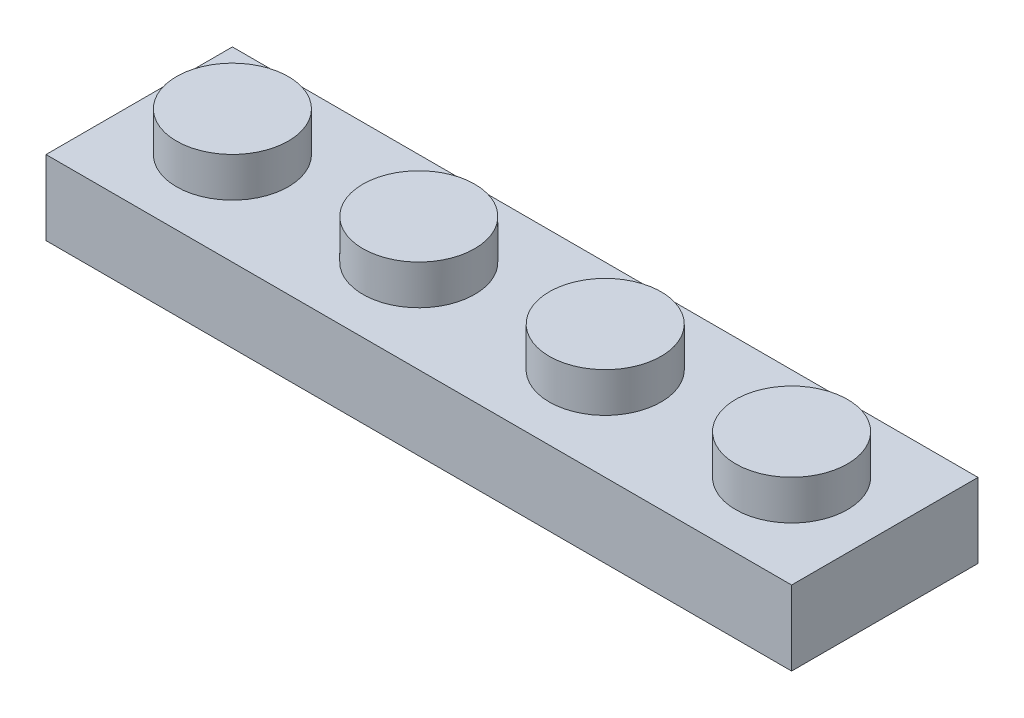
ISO-10303-21;
HEADER;
FILE_DESCRIPTION(('STEP AP214'),'2;1');
FILE_NAME('part.step','',(''),(''),'','','');
FILE_SCHEMA(('AUTOMOTIVE_DESIGN { 1 0 10303 214 1 1 1 1 }'));
ENDSEC;
DATA;
#1=APPLICATION_CONTEXT('core data for automotive mechanical design processes');
#2=APPLICATION_PROTOCOL_DEFINITION('international standard','automotive_design',2000,#1);
#3=PRODUCT_CONTEXT('',#1,'mechanical');
#4=PRODUCT('Part','Part','',(#3));
#5=PRODUCT_RELATED_PRODUCT_CATEGORY('part','',(#4));
#6=PRODUCT_DEFINITION_FORMATION('','',#4);
#7=PRODUCT_DEFINITION_CONTEXT('part definition',#1,'design');
#8=PRODUCT_DEFINITION('design','',#6,#7);
#9=PRODUCT_DEFINITION_SHAPE('','',#8);
#10=(LENGTH_UNIT() NAMED_UNIT(*) SI_UNIT(.MILLI.,.METRE.));
#11=(NAMED_UNIT(*) PLANE_ANGLE_UNIT() SI_UNIT($,.RADIAN.));
#12=(NAMED_UNIT(*) SI_UNIT($,.STERADIAN.) SOLID_ANGLE_UNIT());
#13=UNCERTAINTY_MEASURE_WITH_UNIT(LENGTH_MEASURE(1.E-05),#10,'distance_accuracy_value','');
#14=(GEOMETRIC_REPRESENTATION_CONTEXT(3) GLOBAL_UNCERTAINTY_ASSIGNED_CONTEXT((#13)) GLOBAL_UNIT_ASSIGNED_CONTEXT((#10,
#11,#12)) REPRESENTATION_CONTEXT('',''));
#15=CARTESIAN_POINT('',(0.,0.,0.));
#16=DIRECTION('',(0.,0.,1.));
#17=DIRECTION('',(1.,0.,0.));
#18=AXIS2_PLACEMENT_3D('',#15,#16,#17);
#19=CARTESIAN_POINT('',(0.,0.,0.));
#20=DIRECTION('',(0.,-1.,0.));
#21=DIRECTION('',(0.,0.,-1.));
#22=AXIS2_PLACEMENT_3D('',#19,#20,#21);
#23=PLANE('',#22);
#24=DIRECTION('',(-1.,0.,0.));
#25=VECTOR('',#24,1.);
#26=CARTESIAN_POINT('',(-4.,0.,-4.));
#27=LINE('',#26,#25);
#28=CARTESIAN_POINT('',(28.,0.,-4.));
#29=VERTEX_POINT('',#28);
#30=CARTESIAN_POINT('',(-4.,0.,-4.));
#31=VERTEX_POINT('',#30);
#32=EDGE_CURVE('E81',#29,#31,#27,.T.);
#33=ORIENTED_EDGE('',*,*,#32,.F.);
#34=DIRECTION('',(0.,0.,-1.));
#35=VECTOR('',#34,1.);
#36=CARTESIAN_POINT('',(28.,0.,4.));
#37=LINE('',#36,#35);
#38=CARTESIAN_POINT('',(28.,0.,4.));
#39=VERTEX_POINT('',#38);
#40=EDGE_CURVE('E94',#39,#29,#37,.T.);
#41=ORIENTED_EDGE('',*,*,#40,.F.);
#42=DIRECTION('',(1.,0.,0.));
#43=VECTOR('',#42,1.);
#44=CARTESIAN_POINT('',(-4.,0.,4.));
#45=LINE('',#44,#43);
#46=CARTESIAN_POINT('',(-4.,0.,4.));
#47=VERTEX_POINT('',#46);
#48=EDGE_CURVE('E80',#47,#39,#45,.T.);
#49=ORIENTED_EDGE('',*,*,#48,.F.);
#50=DIRECTION('',(0.,0.,1.));
#51=VECTOR('',#50,1.);
#52=CARTESIAN_POINT('',(-4.,0.,4.));
#53=LINE('',#52,#51);
#54=EDGE_CURVE('E70',#31,#47,#53,.T.);
#55=ORIENTED_EDGE('',*,*,#54,.F.);
#56=EDGE_LOOP('',(#33,#41,#49,#55));
#57=FACE_BOUND('',#56,.T.);
#58=DIRECTION('',(0.,0.,-1.));
#59=VECTOR('',#58,1.);
#60=CARTESIAN_POINT('',(26.4,0.,0.));
#61=LINE('',#60,#59);
#62=CARTESIAN_POINT('',(26.4,0.,2.4));
#63=VERTEX_POINT('',#62);
#64=CARTESIAN_POINT('',(26.4,0.,-2.4));
#65=VERTEX_POINT('',#64);
#66=EDGE_CURVE('E395',#63,#65,#61,.T.);
#67=ORIENTED_EDGE('',*,*,#66,.T.);
#68=DIRECTION('',(-1.,0.,0.));
#69=VECTOR('',#68,1.);
#70=CARTESIAN_POINT('',(0.,0.,-2.4));
#71=LINE('',#70,#69);
#72=CARTESIAN_POINT('',(-2.4,0.,-2.4));
#73=VERTEX_POINT('',#72);
#74=EDGE_CURVE('E392',#65,#73,#71,.T.);
#75=ORIENTED_EDGE('',*,*,#74,.T.);
#76=DIRECTION('',(0.,0.,1.));
#77=VECTOR('',#76,1.);
#78=CARTESIAN_POINT('',(-2.4,0.,0.));
#79=LINE('',#78,#77);
#80=CARTESIAN_POINT('',(-2.4,0.,2.4));
#81=VERTEX_POINT('',#80);
#82=EDGE_CURVE('E389',#73,#81,#79,.T.);
#83=ORIENTED_EDGE('',*,*,#82,.T.);
#84=DIRECTION('',(1.,0.,0.));
#85=VECTOR('',#84,1.);
#86=CARTESIAN_POINT('',(0.,0.,2.4));
#87=LINE('',#86,#85);
#88=EDGE_CURVE('E48',#81,#63,#87,.T.);
#89=ORIENTED_EDGE('',*,*,#88,.T.);
#90=EDGE_LOOP('',(#67,#75,#83,#89));
#91=FACE_BOUND('',#90,.T.);
#92=ADVANCED_FACE('F33',(#57,#91),#23,.T.);
#93=CARTESIAN_POINT('',(24.,4.9,0.));
#94=DIRECTION('',(0.,1.,0.));
#95=DIRECTION('',(0.,0.,1.));
#96=AXIS2_PLACEMENT_3D('',#93,#94,#95);
#97=PLANE('',#96);
#98=CARTESIAN_POINT('',(24.,4.9,0.));
#99=DIRECTION('',(0.,1.,0.));
#100=DIRECTION('',(0.,0.,1.));
#101=AXIS2_PLACEMENT_3D('',#98,#99,#100);
#102=CIRCLE('',#101,2.4);
#103=CARTESIAN_POINT('',(24.,4.9,2.4));
#104=VERTEX_POINT('',#103);
#105=EDGE_CURVE('E11',#104,#104,#102,.T.);
#106=ORIENTED_EDGE('',*,*,#105,.T.);
#107=EDGE_LOOP('',(#106));
#108=FACE_BOUND('',#107,.T.);
#109=ADVANCED_FACE('F35',(#108),#97,.T.);
#110=CARTESIAN_POINT('',(24.,4.9,0.));
#111=DIRECTION('',(0.,-1.,0.));
#112=DIRECTION('',(0.,0.,-1.));
#113=AXIS2_PLACEMENT_3D('',#110,#111,#112);
#114=CYLINDRICAL_SURFACE('',#113,2.4);
#115=ORIENTED_EDGE('',*,*,#105,.F.);
#116=EDGE_LOOP('',(#115));
#117=FACE_BOUND('',#116,.T.);
#118=CARTESIAN_POINT('',(24.,3.2,0.));
#119=DIRECTION('',(0.,1.,0.));
#120=DIRECTION('',(0.,0.,1.));
#121=AXIS2_PLACEMENT_3D('',#118,#119,#120);
#122=CIRCLE('',#121,2.4);
#123=CARTESIAN_POINT('',(24.,3.2,2.4));
#124=VERTEX_POINT('',#123);
#125=EDGE_CURVE('E41',#124,#124,#122,.T.);
#126=ORIENTED_EDGE('',*,*,#125,.T.);
#127=EDGE_LOOP('',(#126));
#128=FACE_BOUND('',#127,.T.);
#129=ADVANCED_FACE('F113',(#117,#128),#114,.T.);
#130=CARTESIAN_POINT('',(16.,4.9,0.));
#131=DIRECTION('',(0.,1.,0.));
#132=DIRECTION('',(0.,0.,1.));
#133=AXIS2_PLACEMENT_3D('',#130,#131,#132);
#134=PLANE('',#133);
#135=CARTESIAN_POINT('',(16.,4.9,0.));
#136=DIRECTION('',(0.,1.,0.));
#137=DIRECTION('',(0.,0.,1.));
#138=AXIS2_PLACEMENT_3D('',#135,#136,#137);
#139=CIRCLE('',#138,2.4);
#140=CARTESIAN_POINT('',(16.,4.9,2.4));
#141=VERTEX_POINT('',#140);
#142=EDGE_CURVE('E108',#141,#141,#139,.T.);
#143=ORIENTED_EDGE('',*,*,#142,.T.);
#144=EDGE_LOOP('',(#143));
#145=FACE_BOUND('',#144,.T.);
#146=ADVANCED_FACE('F146',(#145),#134,.T.);
#147=CARTESIAN_POINT('',(16.,4.9,0.));
#148=DIRECTION('',(0.,-1.,0.));
#149=DIRECTION('',(0.,0.,-1.));
#150=AXIS2_PLACEMENT_3D('',#147,#148,#149);
#151=CYLINDRICAL_SURFACE('',#150,2.4);
#152=ORIENTED_EDGE('',*,*,#142,.F.);
#153=EDGE_LOOP('',(#152));
#154=FACE_BOUND('',#153,.T.);
#155=CARTESIAN_POINT('',(16.,3.2,0.));
#156=DIRECTION('',(0.,1.,0.));
#157=DIRECTION('',(0.,0.,1.));
#158=AXIS2_PLACEMENT_3D('',#155,#156,#157);
#159=CIRCLE('',#158,2.4);
#160=CARTESIAN_POINT('',(16.,3.2,2.4));
#161=VERTEX_POINT('',#160);
#162=EDGE_CURVE('E105',#161,#161,#159,.T.);
#163=ORIENTED_EDGE('',*,*,#162,.T.);
#164=EDGE_LOOP('',(#163));
#165=FACE_BOUND('',#164,.T.);
#166=ADVANCED_FACE('F142',(#154,#165),#151,.T.);
#167=CARTESIAN_POINT('',(-4.,3.2,-4.));
#168=DIRECTION('',(0.,0.,1.));
#169=DIRECTION('',(1.,0.,0.));
#170=AXIS2_PLACEMENT_3D('',#167,#168,#169);
#171=PLANE('',#170);
#172=ORIENTED_EDGE('',*,*,#32,.T.);
#173=DIRECTION('',(0.,-1.,0.));
#174=VECTOR('',#173,1.);
#175=CARTESIAN_POINT('',(-4.,3.2,-4.));
#176=LINE('',#175,#174);
#177=CARTESIAN_POINT('',(-4.,3.2,-4.));
#178=VERTEX_POINT('',#177);
#179=EDGE_CURVE('E76',#178,#31,#176,.T.);
#180=ORIENTED_EDGE('',*,*,#179,.F.);
#181=DIRECTION('',(-1.,0.,0.));
#182=VECTOR('',#181,1.);
#183=CARTESIAN_POINT('',(-4.,3.2,-4.));
#184=LINE('',#183,#182);
#185=CARTESIAN_POINT('',(28.,3.2,-4.));
#186=VERTEX_POINT('',#185);
#187=EDGE_CURVE('E95',#186,#178,#184,.T.);
#188=ORIENTED_EDGE('',*,*,#187,.F.);
#189=DIRECTION('',(0.,-1.,0.));
#190=VECTOR('',#189,1.);
#191=CARTESIAN_POINT('',(28.,3.2,-4.));
#192=LINE('',#191,#190);
#193=EDGE_CURVE('E365',#186,#29,#192,.T.);
#194=ORIENTED_EDGE('',*,*,#193,.T.);
#195=EDGE_LOOP('',(#172,#180,#188,#194));
#196=FACE_BOUND('',#195,.T.);
#197=ADVANCED_FACE('F139',(#196),#171,.F.);
#198=CARTESIAN_POINT('',(-4.,3.2,4.));
#199=DIRECTION('',(1.,0.,0.));
#200=DIRECTION('',(0.,0.,-1.));
#201=AXIS2_PLACEMENT_3D('',#198,#199,#200);
#202=PLANE('',#201);
#203=ORIENTED_EDGE('',*,*,#54,.T.);
#204=DIRECTION('',(0.,-1.,0.));
#205=VECTOR('',#204,1.);
#206=CARTESIAN_POINT('',(-4.,3.2,4.));
#207=LINE('',#206,#205);
#208=CARTESIAN_POINT('',(-4.,3.2,4.));
#209=VERTEX_POINT('',#208);
#210=EDGE_CURVE('E73',#209,#47,#207,.T.);
#211=ORIENTED_EDGE('',*,*,#210,.F.);
#212=DIRECTION('',(0.,0.,1.));
#213=VECTOR('',#212,1.);
#214=CARTESIAN_POINT('',(-4.,3.2,4.));
#215=LINE('',#214,#213);
#216=EDGE_CURVE('E57',#178,#209,#215,.T.);
#217=ORIENTED_EDGE('',*,*,#216,.F.);
#218=ORIENTED_EDGE('',*,*,#179,.T.);
#219=EDGE_LOOP('',(#203,#211,#217,#218));
#220=FACE_BOUND('',#219,.T.);
#221=ADVANCED_FACE('F72',(#220),#202,.F.);
#222=CARTESIAN_POINT('',(-4.,3.2,4.));
#223=DIRECTION('',(0.,0.,-1.));
#224=DIRECTION('',(-1.,0.,0.));
#225=AXIS2_PLACEMENT_3D('',#222,#223,#224);
#226=PLANE('',#225);
#227=ORIENTED_EDGE('',*,*,#48,.T.);
#228=DIRECTION('',(0.,-1.,0.));
#229=VECTOR('',#228,1.);
#230=CARTESIAN_POINT('',(28.,3.2,4.));
#231=LINE('',#230,#229);
#232=CARTESIAN_POINT('',(28.,3.2,4.));
#233=VERTEX_POINT('',#232);
#234=EDGE_CURVE('E368',#233,#39,#231,.T.);
#235=ORIENTED_EDGE('',*,*,#234,.F.);
#236=DIRECTION('',(1.,0.,0.));
#237=VECTOR('',#236,1.);
#238=CARTESIAN_POINT('',(-4.,3.2,4.));
#239=LINE('',#238,#237);
#240=EDGE_CURVE('E89',#209,#233,#239,.T.);
#241=ORIENTED_EDGE('',*,*,#240,.F.);
#242=ORIENTED_EDGE('',*,*,#210,.T.);
#243=EDGE_LOOP('',(#227,#235,#241,#242));
#244=FACE_BOUND('',#243,.T.);
#245=ADVANCED_FACE('F85',(#244),#226,.F.);
#246=CARTESIAN_POINT('',(0.,3.2,0.));
#247=DIRECTION('',(0.,-1.,0.));
#248=DIRECTION('',(0.,0.,-1.));
#249=AXIS2_PLACEMENT_3D('',#246,#247,#248);
#250=PLANE('',#249);
#251=CARTESIAN_POINT('',(8.,3.2,0.));
#252=DIRECTION('',(0.,-1.,0.));
#253=DIRECTION('',(0.,0.,-1.));
#254=AXIS2_PLACEMENT_3D('',#251,#252,#253);
#255=CIRCLE('',#254,2.4);
#256=CARTESIAN_POINT('',(8.,3.2,-2.4));
#257=VERTEX_POINT('',#256);
#258=EDGE_CURVE('E102',#257,#257,#255,.F.);
#259=ORIENTED_EDGE('',*,*,#258,.F.);
#260=EDGE_LOOP('',(#259));
#261=FACE_BOUND('',#260,.T.);
#262=CARTESIAN_POINT('',(0.,3.2,0.));
#263=DIRECTION('',(0.,1.,0.));
#264=DIRECTION('',(0.,0.,1.));
#265=AXIS2_PLACEMENT_3D('',#262,#263,#264);
#266=CIRCLE('',#265,2.4);
#267=CARTESIAN_POINT('',(0.,3.2,2.4));
#268=VERTEX_POINT('',#267);
#269=EDGE_CURVE('E101',#268,#268,#266,.T.);
#270=ORIENTED_EDGE('',*,*,#269,.F.);
#271=EDGE_LOOP('',(#270));
#272=FACE_BOUND('',#271,.T.);
#273=ORIENTED_EDGE('',*,*,#240,.T.);
#274=DIRECTION('',(0.,0.,-1.));
#275=VECTOR('',#274,1.);
#276=CARTESIAN_POINT('',(28.,3.2,4.));
#277=LINE('',#276,#275);
#278=EDGE_CURVE('E379',#233,#186,#277,.T.);
#279=ORIENTED_EDGE('',*,*,#278,.T.);
#280=ORIENTED_EDGE('',*,*,#187,.T.);
#281=ORIENTED_EDGE('',*,*,#216,.T.);
#282=EDGE_LOOP('',(#273,#279,#280,#281));
#283=FACE_BOUND('',#282,.T.);
#284=ORIENTED_EDGE('',*,*,#162,.F.);
#285=EDGE_LOOP('',(#284));
#286=FACE_BOUND('',#285,.T.);
#287=ORIENTED_EDGE('',*,*,#125,.F.);
#288=EDGE_LOOP('',(#287));
#289=FACE_BOUND('',#288,.T.);
#290=ADVANCED_FACE('F115',(#261,#272,#283,#286,#289),#250,.F.);
#291=CARTESIAN_POINT('',(0.,4.9,0.));
#292=DIRECTION('',(0.,-1.,0.));
#293=DIRECTION('',(0.,0.,-1.));
#294=AXIS2_PLACEMENT_3D('',#291,#292,#293);
#295=CYLINDRICAL_SURFACE('',#294,2.4);
#296=CARTESIAN_POINT('',(0.,4.9,0.));
#297=DIRECTION('',(0.,1.,0.));
#298=DIRECTION('',(0.,0.,1.));
#299=AXIS2_PLACEMENT_3D('',#296,#297,#298);
#300=CIRCLE('',#299,2.4);
#301=CARTESIAN_POINT('',(0.,4.9,2.4));
#302=VERTEX_POINT('',#301);
#303=EDGE_CURVE('E364',#302,#302,#300,.T.);
#304=ORIENTED_EDGE('',*,*,#303,.F.);
#305=EDGE_LOOP('',(#304));
#306=FACE_BOUND('',#305,.T.);
#307=ORIENTED_EDGE('',*,*,#269,.T.);
#308=EDGE_LOOP('',(#307));
#309=FACE_BOUND('',#308,.T.);
#310=ADVANCED_FACE('F117',(#306,#309),#295,.T.);
#311=CARTESIAN_POINT('',(0.,4.9,0.));
#312=DIRECTION('',(0.,1.,0.));
#313=DIRECTION('',(0.,0.,1.));
#314=AXIS2_PLACEMENT_3D('',#311,#312,#313);
#315=PLANE('',#314);
#316=ORIENTED_EDGE('',*,*,#303,.T.);
#317=EDGE_LOOP('',(#316));
#318=FACE_BOUND('',#317,.T.);
#319=ADVANCED_FACE('F124',(#318),#315,.T.);
#320=CARTESIAN_POINT('',(28.,3.2,4.));
#321=DIRECTION('',(-1.,0.,0.));
#322=DIRECTION('',(0.,0.,1.));
#323=AXIS2_PLACEMENT_3D('',#320,#321,#322);
#324=PLANE('',#323);
#325=ORIENTED_EDGE('',*,*,#40,.T.);
#326=ORIENTED_EDGE('',*,*,#193,.F.);
#327=ORIENTED_EDGE('',*,*,#278,.F.);
#328=ORIENTED_EDGE('',*,*,#234,.T.);
#329=EDGE_LOOP('',(#325,#326,#327,#328));
#330=FACE_BOUND('',#329,.T.);
#331=ADVANCED_FACE('F190',(#330),#324,.F.);
#332=CARTESIAN_POINT('',(8.,4.9,0.));
#333=DIRECTION('',(0.,-1.,0.));
#334=DIRECTION('',(0.,0.,-1.));
#335=AXIS2_PLACEMENT_3D('',#332,#333,#334);
#336=CYLINDRICAL_SURFACE('',#335,2.4);
#337=CARTESIAN_POINT('',(8.,4.9,0.));
#338=DIRECTION('',(0.,1.,0.));
#339=DIRECTION('',(0.,0.,1.));
#340=AXIS2_PLACEMENT_3D('',#337,#338,#339);
#341=CIRCLE('',#340,2.4);
#342=CARTESIAN_POINT('',(8.,4.9,2.4));
#343=VERTEX_POINT('',#342);
#344=EDGE_CURVE('E383',#343,#343,#341,.T.);
#345=ORIENTED_EDGE('',*,*,#344,.F.);
#346=EDGE_LOOP('',(#345));
#347=FACE_BOUND('',#346,.T.);
#348=ORIENTED_EDGE('',*,*,#258,.T.);
#349=EDGE_LOOP('',(#348));
#350=FACE_BOUND('',#349,.T.);
#351=ADVANCED_FACE('F194',(#347,#350),#336,.T.);
#352=CARTESIAN_POINT('',(8.,4.9,0.));
#353=DIRECTION('',(0.,1.,0.));
#354=DIRECTION('',(0.,0.,1.));
#355=AXIS2_PLACEMENT_3D('',#352,#353,#354);
#356=PLANE('',#355);
#357=ORIENTED_EDGE('',*,*,#344,.T.);
#358=EDGE_LOOP('',(#357));
#359=FACE_BOUND('',#358,.T.);
#360=ADVANCED_FACE('F206',(#359),#356,.T.);
#361=CARTESIAN_POINT('',(24.,3.3,0.));
#362=DIRECTION('',(0.,1.,0.));
#363=DIRECTION('',(0.,0.,1.));
#364=AXIS2_PLACEMENT_3D('',#361,#362,#363);
#365=PLANE('',#364);
#366=CARTESIAN_POINT('',(24.,3.3,0.));
#367=DIRECTION('',(0.,1.,0.));
#368=DIRECTION('',(0.,0.,1.));
#369=AXIS2_PLACEMENT_3D('',#366,#367,#368);
#370=CIRCLE('',#369,0.8);
#371=CARTESIAN_POINT('',(24.,3.3,0.8));
#372=VERTEX_POINT('',#371);
#373=EDGE_CURVE('E388',#372,#372,#370,.T.);
#374=ORIENTED_EDGE('',*,*,#373,.F.);
#375=EDGE_LOOP('',(#374));
#376=FACE_BOUND('',#375,.T.);
#377=ADVANCED_FACE('F215',(#376),#365,.F.);
#378=CARTESIAN_POINT('',(24.,4.9,0.));
#379=DIRECTION('',(0.,-1.,0.));
#380=DIRECTION('',(0.,0.,-1.));
#381=AXIS2_PLACEMENT_3D('',#378,#379,#380);
#382=CYLINDRICAL_SURFACE('',#381,0.8);
#383=ORIENTED_EDGE('',*,*,#373,.T.);
#384=EDGE_LOOP('',(#383));
#385=FACE_BOUND('',#384,.T.);
#386=CARTESIAN_POINT('',(24.,1.6,0.));
#387=DIRECTION('',(0.,-1.,0.));
#388=DIRECTION('',(0.,0.,-1.));
#389=AXIS2_PLACEMENT_3D('',#386,#387,#388);
#390=CIRCLE('',#389,0.8);
#391=CARTESIAN_POINT('',(24.,1.6,-0.8));
#392=VERTEX_POINT('',#391);
#393=EDGE_CURVE('E422',#392,#392,#390,.F.);
#394=ORIENTED_EDGE('',*,*,#393,.F.);
#395=EDGE_LOOP('',(#394));
#396=FACE_BOUND('',#395,.T.);
#397=ADVANCED_FACE('F231',(#385,#396),#382,.F.);
#398=CARTESIAN_POINT('',(16.,3.3,0.));
#399=DIRECTION('',(0.,1.,0.));
#400=DIRECTION('',(0.,0.,1.));
#401=AXIS2_PLACEMENT_3D('',#398,#399,#400);
#402=PLANE('',#401);
#403=CARTESIAN_POINT('',(16.,3.3,0.));
#404=DIRECTION('',(0.,1.,0.));
#405=DIRECTION('',(0.,0.,1.));
#406=AXIS2_PLACEMENT_3D('',#403,#404,#405);
#407=CIRCLE('',#406,0.8);
#408=CARTESIAN_POINT('',(16.,3.3,0.8));
#409=VERTEX_POINT('',#408);
#410=EDGE_CURVE('E419',#409,#409,#407,.T.);
#411=ORIENTED_EDGE('',*,*,#410,.F.);
#412=EDGE_LOOP('',(#411));
#413=FACE_BOUND('',#412,.T.);
#414=ADVANCED_FACE('F241',(#413),#402,.F.);
#415=CARTESIAN_POINT('',(16.,4.9,0.));
#416=DIRECTION('',(0.,-1.,0.));
#417=DIRECTION('',(0.,0.,-1.));
#418=AXIS2_PLACEMENT_3D('',#415,#416,#417);
#419=CYLINDRICAL_SURFACE('',#418,0.8);
#420=ORIENTED_EDGE('',*,*,#410,.T.);
#421=EDGE_LOOP('',(#420));
#422=FACE_BOUND('',#421,.T.);
#423=CARTESIAN_POINT('',(16.,1.6,0.));
#424=DIRECTION('',(0.,-1.,0.));
#425=DIRECTION('',(0.,0.,-1.));
#426=AXIS2_PLACEMENT_3D('',#423,#424,#425);
#427=CIRCLE('',#426,0.8);
#428=CARTESIAN_POINT('',(16.,1.6,-0.8));
#429=VERTEX_POINT('',#428);
#430=EDGE_CURVE('E423',#429,#429,#427,.F.);
#431=ORIENTED_EDGE('',*,*,#430,.F.);
#432=EDGE_LOOP('',(#431));
#433=FACE_BOUND('',#432,.T.);
#434=ADVANCED_FACE('F251',(#422,#433),#419,.F.);
#435=CARTESIAN_POINT('',(-4.,3.2,-2.4));
#436=DIRECTION('',(0.,0.,1.));
#437=DIRECTION('',(1.,0.,0.));
#438=AXIS2_PLACEMENT_3D('',#435,#436,#437);
#439=PLANE('',#438);
#440=ORIENTED_EDGE('',*,*,#74,.F.);
#441=DIRECTION('',(0.,-1.,0.));
#442=VECTOR('',#441,1.);
#443=CARTESIAN_POINT('',(26.4,3.2,-2.4));
#444=LINE('',#443,#442);
#445=CARTESIAN_POINT('',(26.4,1.6,-2.4));
#446=VERTEX_POINT('',#445);
#447=EDGE_CURVE('E407',#446,#65,#444,.T.);
#448=ORIENTED_EDGE('',*,*,#447,.F.);
#449=DIRECTION('',(-1.,0.,0.));
#450=VECTOR('',#449,1.);
#451=CARTESIAN_POINT('',(0.,1.6,-2.4));
#452=LINE('',#451,#450);
#453=CARTESIAN_POINT('',(-2.4,1.6,-2.4));
#454=VERTEX_POINT('',#453);
#455=EDGE_CURVE('E394',#446,#454,#452,.T.);
#456=ORIENTED_EDGE('',*,*,#455,.T.);
#457=DIRECTION('',(0.,-1.,0.));
#458=VECTOR('',#457,1.);
#459=CARTESIAN_POINT('',(-2.4,3.2,-2.4));
#460=LINE('',#459,#458);
#461=EDGE_CURVE('E412',#454,#73,#460,.T.);
#462=ORIENTED_EDGE('',*,*,#461,.T.);
#463=EDGE_LOOP('',(#440,#448,#456,#462));
#464=FACE_BOUND('',#463,.T.);
#465=ADVANCED_FACE('F261',(#464),#439,.T.);
#466=CARTESIAN_POINT('',(-2.4,3.2,4.));
#467=DIRECTION('',(1.,0.,0.));
#468=DIRECTION('',(0.,0.,-1.));
#469=AXIS2_PLACEMENT_3D('',#466,#467,#468);
#470=PLANE('',#469);
#471=ORIENTED_EDGE('',*,*,#82,.F.);
#472=ORIENTED_EDGE('',*,*,#461,.F.);
#473=DIRECTION('',(0.,0.,1.));
#474=VECTOR('',#473,1.);
#475=CARTESIAN_POINT('',(-2.4,1.6,0.));
#476=LINE('',#475,#474);
#477=CARTESIAN_POINT('',(-2.4,1.6,2.4));
#478=VERTEX_POINT('',#477);
#479=EDGE_CURVE('E427',#454,#478,#476,.T.);
#480=ORIENTED_EDGE('',*,*,#479,.T.);
#481=DIRECTION('',(0.,-1.,0.));
#482=VECTOR('',#481,1.);
#483=CARTESIAN_POINT('',(-2.4,3.2,2.4));
#484=LINE('',#483,#482);
#485=EDGE_CURVE('E410',#478,#81,#484,.T.);
#486=ORIENTED_EDGE('',*,*,#485,.T.);
#487=EDGE_LOOP('',(#471,#472,#480,#486));
#488=FACE_BOUND('',#487,.T.);
#489=ADVANCED_FACE('F272',(#488),#470,.T.);
#490=CARTESIAN_POINT('',(-4.,3.2,2.4));
#491=DIRECTION('',(0.,0.,-1.));
#492=DIRECTION('',(-1.,0.,0.));
#493=AXIS2_PLACEMENT_3D('',#490,#491,#492);
#494=PLANE('',#493);
#495=ORIENTED_EDGE('',*,*,#88,.F.);
#496=ORIENTED_EDGE('',*,*,#485,.F.);
#497=DIRECTION('',(1.,0.,0.));
#498=VECTOR('',#497,1.);
#499=CARTESIAN_POINT('',(0.,1.6,2.4));
#500=LINE('',#499,#498);
#501=CARTESIAN_POINT('',(26.4,1.6,2.4));
#502=VERTEX_POINT('',#501);
#503=EDGE_CURVE('E413',#478,#502,#500,.T.);
#504=ORIENTED_EDGE('',*,*,#503,.T.);
#505=DIRECTION('',(0.,-1.,0.));
#506=VECTOR('',#505,1.);
#507=CARTESIAN_POINT('',(26.4,3.2,2.4));
#508=LINE('',#507,#506);
#509=EDGE_CURVE('E408',#502,#63,#508,.T.);
#510=ORIENTED_EDGE('',*,*,#509,.T.);
#511=EDGE_LOOP('',(#495,#496,#504,#510));
#512=FACE_BOUND('',#511,.T.);
#513=ADVANCED_FACE('F282',(#512),#494,.T.);
#514=CARTESIAN_POINT('',(0.,1.6,0.));
#515=DIRECTION('',(0.,-1.,0.));
#516=DIRECTION('',(0.,0.,-1.));
#517=AXIS2_PLACEMENT_3D('',#514,#515,#516);
#518=PLANE('',#517);
#519=CARTESIAN_POINT('',(8.,1.6,0.));
#520=DIRECTION('',(0.,-1.,0.));
#521=DIRECTION('',(0.,0.,-1.));
#522=AXIS2_PLACEMENT_3D('',#519,#520,#521);
#523=CIRCLE('',#522,0.8);
#524=CARTESIAN_POINT('',(8.,1.6,-0.8));
#525=VERTEX_POINT('',#524);
#526=EDGE_CURVE('E426',#525,#525,#523,.F.);
#527=ORIENTED_EDGE('',*,*,#526,.T.);
#528=EDGE_LOOP('',(#527));
#529=FACE_BOUND('',#528,.T.);
#530=CARTESIAN_POINT('',(0.,1.6,0.));
#531=DIRECTION('',(0.,-1.,0.));
#532=DIRECTION('',(0.,0.,-1.));
#533=AXIS2_PLACEMENT_3D('',#530,#531,#532);
#534=CIRCLE('',#533,0.8);
#535=CARTESIAN_POINT('',(0.,1.6,-0.8));
#536=VERTEX_POINT('',#535);
#537=EDGE_CURVE('E418',#536,#536,#534,.F.);
#538=ORIENTED_EDGE('',*,*,#537,.T.);
#539=EDGE_LOOP('',(#538));
#540=FACE_BOUND('',#539,.T.);
#541=ORIENTED_EDGE('',*,*,#503,.F.);
#542=ORIENTED_EDGE('',*,*,#479,.F.);
#543=ORIENTED_EDGE('',*,*,#455,.F.);
#544=DIRECTION('',(0.,0.,-1.));
#545=VECTOR('',#544,1.);
#546=CARTESIAN_POINT('',(26.4,1.6,0.));
#547=LINE('',#546,#545);
#548=EDGE_CURVE('E398',#502,#446,#547,.T.);
#549=ORIENTED_EDGE('',*,*,#548,.F.);
#550=EDGE_LOOP('',(#541,#542,#543,#549));
#551=FACE_BOUND('',#550,.T.);
#552=ORIENTED_EDGE('',*,*,#430,.T.);
#553=EDGE_LOOP('',(#552));
#554=FACE_BOUND('',#553,.T.);
#555=ORIENTED_EDGE('',*,*,#393,.T.);
#556=EDGE_LOOP('',(#555));
#557=FACE_BOUND('',#556,.T.);
#558=ADVANCED_FACE('F293',(#529,#540,#551,#554,#557),#518,.T.);
#559=CARTESIAN_POINT('',(0.,4.9,0.));
#560=DIRECTION('',(0.,-1.,0.));
#561=DIRECTION('',(0.,0.,-1.));
#562=AXIS2_PLACEMENT_3D('',#559,#560,#561);
#563=CYLINDRICAL_SURFACE('',#562,0.8);
#564=CARTESIAN_POINT('',(0.,3.3,0.));
#565=DIRECTION('',(0.,1.,0.));
#566=DIRECTION('',(0.,0.,1.));
#567=AXIS2_PLACEMENT_3D('',#564,#565,#566);
#568=CIRCLE('',#567,0.8);
#569=CARTESIAN_POINT('',(0.,3.3,0.8));
#570=VERTEX_POINT('',#569);
#571=EDGE_CURVE('E402',#570,#570,#568,.T.);
#572=ORIENTED_EDGE('',*,*,#571,.T.);
#573=EDGE_LOOP('',(#572));
#574=FACE_BOUND('',#573,.T.);
#575=ORIENTED_EDGE('',*,*,#537,.F.);
#576=EDGE_LOOP('',(#575));
#577=FACE_BOUND('',#576,.T.);
#578=ADVANCED_FACE('F303',(#574,#577),#563,.F.);
#579=CARTESIAN_POINT('',(0.,3.3,0.));
#580=DIRECTION('',(0.,1.,0.));
#581=DIRECTION('',(0.,0.,1.));
#582=AXIS2_PLACEMENT_3D('',#579,#580,#581);
#583=PLANE('',#582);
#584=ORIENTED_EDGE('',*,*,#571,.F.);
#585=EDGE_LOOP('',(#584));
#586=FACE_BOUND('',#585,.T.);
#587=ADVANCED_FACE('F313',(#586),#583,.F.);
#588=CARTESIAN_POINT('',(26.4,3.2,4.));
#589=DIRECTION('',(-1.,0.,0.));
#590=DIRECTION('',(0.,0.,1.));
#591=AXIS2_PLACEMENT_3D('',#588,#589,#590);
#592=PLANE('',#591);
#593=ORIENTED_EDGE('',*,*,#66,.F.);
#594=ORIENTED_EDGE('',*,*,#509,.F.);
#595=ORIENTED_EDGE('',*,*,#548,.T.);
#596=ORIENTED_EDGE('',*,*,#447,.T.);
#597=EDGE_LOOP('',(#593,#594,#595,#596));
#598=FACE_BOUND('',#597,.T.);
#599=ADVANCED_FACE('F323',(#598),#592,.T.);
#600=CARTESIAN_POINT('',(8.,4.9,0.));
#601=DIRECTION('',(0.,-1.,0.));
#602=DIRECTION('',(0.,0.,-1.));
#603=AXIS2_PLACEMENT_3D('',#600,#601,#602);
#604=CYLINDRICAL_SURFACE('',#603,0.8);
#605=CARTESIAN_POINT('',(8.,3.3,0.));
#606=DIRECTION('',(0.,1.,0.));
#607=DIRECTION('',(0.,0.,1.));
#608=AXIS2_PLACEMENT_3D('',#605,#606,#607);
#609=CIRCLE('',#608,0.8);
#610=CARTESIAN_POINT('',(8.,3.3,0.8));
#611=VERTEX_POINT('',#610);
#612=EDGE_CURVE('E399',#611,#611,#609,.T.);
#613=ORIENTED_EDGE('',*,*,#612,.T.);
#614=EDGE_LOOP('',(#613));
#615=FACE_BOUND('',#614,.T.);
#616=ORIENTED_EDGE('',*,*,#526,.F.);
#617=EDGE_LOOP('',(#616));
#618=FACE_BOUND('',#617,.T.);
#619=ADVANCED_FACE('F333',(#615,#618),#604,.F.);
#620=CARTESIAN_POINT('',(8.,3.3,0.));
#621=DIRECTION('',(0.,1.,0.));
#622=DIRECTION('',(0.,0.,1.));
#623=AXIS2_PLACEMENT_3D('',#620,#621,#622);
#624=PLANE('',#623);
#625=ORIENTED_EDGE('',*,*,#612,.F.);
#626=EDGE_LOOP('',(#625));
#627=FACE_BOUND('',#626,.T.);
#628=ADVANCED_FACE('F343',(#627),#624,.F.);
#629=CLOSED_SHELL('',(#92,#109,#129,#146,#166,#197,#221,#245,#290,#310,#319,#331,#351,#360,#377,
#397,#414,#434,#465,#489,#513,#558,#578,#587,#599,#619,#628));
#630=MANIFOLD_SOLID_BREP('B2',#629);
#631=ADVANCED_BREP_SHAPE_REPRESENTATION('',(#18,#630),#14);
#632=SHAPE_DEFINITION_REPRESENTATION(#9,#631);
ENDSEC;
END-ISO-10303-21;
